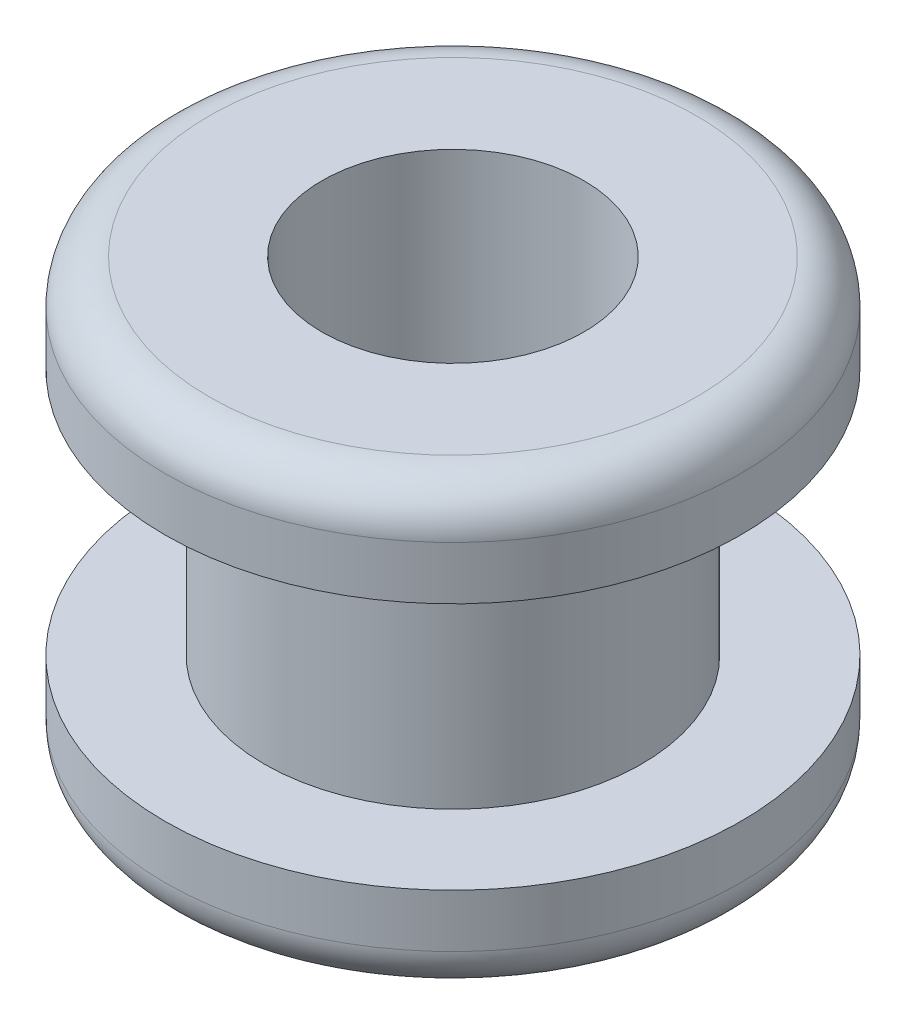
ISO-10303-21;
HEADER;
FILE_DESCRIPTION(('STEP AP214'),'2;1');
FILE_NAME('part.step','',(''),(''),'','','');
FILE_SCHEMA(('AUTOMOTIVE_DESIGN { 1 0 10303 214 1 1 1 1 }'));
ENDSEC;
DATA;
#1=APPLICATION_CONTEXT('core data for automotive mechanical design processes');
#2=APPLICATION_PROTOCOL_DEFINITION('international standard','automotive_design',2000,#1);
#3=PRODUCT_CONTEXT('',#1,'mechanical');
#4=PRODUCT('Part','Part','',(#3));
#5=PRODUCT_RELATED_PRODUCT_CATEGORY('part','',(#4));
#6=PRODUCT_DEFINITION_FORMATION('','',#4);
#7=PRODUCT_DEFINITION_CONTEXT('part definition',#1,'design');
#8=PRODUCT_DEFINITION('design','',#6,#7);
#9=PRODUCT_DEFINITION_SHAPE('','',#8);
#10=(LENGTH_UNIT() NAMED_UNIT(*) SI_UNIT(.MILLI.,.METRE.));
#11=(NAMED_UNIT(*) PLANE_ANGLE_UNIT() SI_UNIT($,.RADIAN.));
#12=(NAMED_UNIT(*) SI_UNIT($,.STERADIAN.) SOLID_ANGLE_UNIT());
#13=UNCERTAINTY_MEASURE_WITH_UNIT(LENGTH_MEASURE(1.E-05),#10,'distance_accuracy_value','');
#14=(GEOMETRIC_REPRESENTATION_CONTEXT(3) GLOBAL_UNCERTAINTY_ASSIGNED_CONTEXT((#13)) GLOBAL_UNIT_ASSIGNED_CONTEXT((#10,
#11,#12)) REPRESENTATION_CONTEXT('',''));
#15=CARTESIAN_POINT('',(0.,0.,0.));
#16=DIRECTION('',(0.,0.,1.));
#17=DIRECTION('',(1.,0.,0.));
#18=AXIS2_PLACEMENT_3D('',#15,#16,#17);
#19=CARTESIAN_POINT('',(0.,5.,0.));
#20=DIRECTION('',(0.,1.,0.));
#21=DIRECTION('',(0.,0.,1.));
#22=AXIS2_PLACEMENT_3D('',#19,#20,#21);
#23=PLANE('',#22);
#24=CARTESIAN_POINT('',(0.,5.,-1.48));
#25=DIRECTION('',(0.,1.,0.));
#26=DIRECTION('',(0.,0.,1.));
#27=AXIS2_PLACEMENT_3D('',#24,#25,#26);
#28=CIRCLE('',#27,2.74999999999999);
#29=CARTESIAN_POINT('',(0.,5.,1.26999999999999));
#30=VERTEX_POINT('',#29);
#31=EDGE_CURVE('E10',#30,#30,#28,.T.);
#32=ORIENTED_EDGE('',*,*,#31,.T.);
#33=EDGE_LOOP('',(#32));
#34=FACE_BOUND('',#33,.T.);
#35=CARTESIAN_POINT('',(0.,5.,-1.48));
#36=DIRECTION('',(0.,1.,0.));
#37=DIRECTION('',(0.,0.,1.));
#38=AXIS2_PLACEMENT_3D('',#35,#36,#37);
#39=CIRCLE('',#38,1.48);
#40=CARTESIAN_POINT('',(0.,5.,0.));
#41=VERTEX_POINT('',#40);
#42=EDGE_CURVE('E65',#41,#41,#39,.T.);
#43=ORIENTED_EDGE('',*,*,#42,.F.);
#44=EDGE_LOOP('',(#43));
#45=FACE_BOUND('',#44,.T.);
#46=ADVANCED_FACE('F31',(#34,#45),#23,.T.);
#47=CARTESIAN_POINT('',(0.,4.5,-1.48));
#48=DIRECTION('',(0.,1.,0.));
#49=DIRECTION('',(0.,0.,1.));
#50=AXIS2_PLACEMENT_3D('',#47,#48,#49);
#51=TOROIDAL_SURFACE('',#50,2.75,0.500000000000003);
#52=CARTESIAN_POINT('',(0.,4.5,-1.48));
#53=DIRECTION('',(0.,1.,0.));
#54=DIRECTION('',(0.,0.,1.));
#55=AXIS2_PLACEMENT_3D('',#52,#53,#54);
#56=CIRCLE('',#55,3.25);
#57=CARTESIAN_POINT('',(0.,4.5,1.77));
#58=VERTEX_POINT('',#57);
#59=EDGE_CURVE('E37',#58,#58,#56,.T.);
#60=ORIENTED_EDGE('',*,*,#59,.T.);
#61=EDGE_LOOP('',(#60));
#62=FACE_BOUND('',#61,.T.);
#63=ORIENTED_EDGE('',*,*,#31,.F.);
#64=EDGE_LOOP('',(#63));
#65=FACE_BOUND('',#64,.T.);
#66=ADVANCED_FACE('F73',(#62,#65),#51,.T.);
#67=CARTESIAN_POINT('',(0.,5.,-1.48));
#68=DIRECTION('',(0.,1.,0.));
#69=DIRECTION('',(0.,0.,1.));
#70=AXIS2_PLACEMENT_3D('',#67,#68,#69);
#71=CYLINDRICAL_SURFACE('',#70,3.25);
#72=CARTESIAN_POINT('',(0.,3.9,-1.48));
#73=DIRECTION('',(0.,1.,0.));
#74=DIRECTION('',(0.,0.,1.));
#75=AXIS2_PLACEMENT_3D('',#72,#73,#74);
#76=CIRCLE('',#75,3.25);
#77=CARTESIAN_POINT('',(0.,3.9,1.77));
#78=VERTEX_POINT('',#77);
#79=EDGE_CURVE('E41',#78,#78,#76,.T.);
#80=ORIENTED_EDGE('',*,*,#79,.T.);
#81=EDGE_LOOP('',(#80));
#82=FACE_BOUND('',#81,.T.);
#83=ORIENTED_EDGE('',*,*,#59,.F.);
#84=EDGE_LOOP('',(#83));
#85=FACE_BOUND('',#84,.T.);
#86=ADVANCED_FACE('F77',(#82,#85),#71,.T.);
#87=CARTESIAN_POINT('',(0.,3.9,0.65));
#88=DIRECTION('',(0.,-1.,0.));
#89=DIRECTION('',(0.,0.,-1.));
#90=AXIS2_PLACEMENT_3D('',#87,#88,#89);
#91=PLANE('',#90);
#92=CARTESIAN_POINT('',(0.,3.9,-1.48));
#93=DIRECTION('',(0.,1.,0.));
#94=DIRECTION('',(0.,0.,1.));
#95=AXIS2_PLACEMENT_3D('',#92,#93,#94);
#96=CIRCLE('',#95,2.13);
#97=CARTESIAN_POINT('',(0.,3.9,0.649999999999999));
#98=VERTEX_POINT('',#97);
#99=EDGE_CURVE('E45',#98,#98,#96,.T.);
#100=ORIENTED_EDGE('',*,*,#99,.T.);
#101=EDGE_LOOP('',(#100));
#102=FACE_BOUND('',#101,.T.);
#103=ORIENTED_EDGE('',*,*,#79,.F.);
#104=EDGE_LOOP('',(#103));
#105=FACE_BOUND('',#104,.T.);
#106=ADVANCED_FACE('F81',(#102,#105),#91,.T.);
#107=CARTESIAN_POINT('',(0.,5.,-1.48));
#108=DIRECTION('',(0.,1.,0.));
#109=DIRECTION('',(0.,0.,1.));
#110=AXIS2_PLACEMENT_3D('',#107,#108,#109);
#111=CYLINDRICAL_SURFACE('',#110,2.13);
#112=CARTESIAN_POINT('',(0.,1.1,-1.48));
#113=DIRECTION('',(0.,1.,0.));
#114=DIRECTION('',(0.,0.,1.));
#115=AXIS2_PLACEMENT_3D('',#112,#113,#114);
#116=CIRCLE('',#115,2.13);
#117=CARTESIAN_POINT('',(0.,1.1,0.649999999999999));
#118=VERTEX_POINT('',#117);
#119=EDGE_CURVE('E50',#118,#118,#116,.T.);
#120=ORIENTED_EDGE('',*,*,#119,.T.);
#121=EDGE_LOOP('',(#120));
#122=FACE_BOUND('',#121,.T.);
#123=ORIENTED_EDGE('',*,*,#99,.F.);
#124=EDGE_LOOP('',(#123));
#125=FACE_BOUND('',#124,.T.);
#126=ADVANCED_FACE('F88',(#122,#125),#111,.T.);
#127=CARTESIAN_POINT('',(0.,1.1,0.649999999999999));
#128=DIRECTION('',(0.,1.,0.));
#129=DIRECTION('',(0.,0.,1.));
#130=AXIS2_PLACEMENT_3D('',#127,#128,#129);
#131=PLANE('',#130);
#132=CARTESIAN_POINT('',(0.,1.1,-1.48));
#133=DIRECTION('',(0.,1.,0.));
#134=DIRECTION('',(0.,0.,1.));
#135=AXIS2_PLACEMENT_3D('',#132,#133,#134);
#136=CIRCLE('',#135,3.25);
#137=CARTESIAN_POINT('',(0.,1.1,1.77));
#138=VERTEX_POINT('',#137);
#139=EDGE_CURVE('E53',#138,#138,#136,.T.);
#140=ORIENTED_EDGE('',*,*,#139,.T.);
#141=EDGE_LOOP('',(#140));
#142=FACE_BOUND('',#141,.T.);
#143=ORIENTED_EDGE('',*,*,#119,.F.);
#144=EDGE_LOOP('',(#143));
#145=FACE_BOUND('',#144,.T.);
#146=ADVANCED_FACE('F92',(#142,#145),#131,.T.);
#147=CARTESIAN_POINT('',(0.,5.,-1.48));
#148=DIRECTION('',(0.,1.,0.));
#149=DIRECTION('',(0.,0.,1.));
#150=AXIS2_PLACEMENT_3D('',#147,#148,#149);
#151=CYLINDRICAL_SURFACE('',#150,3.25);
#152=CARTESIAN_POINT('',(0.,0.500000000000004,-1.48));
#153=DIRECTION('',(0.,1.,0.));
#154=DIRECTION('',(0.,0.,1.));
#155=AXIS2_PLACEMENT_3D('',#152,#153,#154);
#156=CIRCLE('',#155,3.25);
#157=CARTESIAN_POINT('',(0.,0.500000000000003,1.77));
#158=VERTEX_POINT('',#157);
#159=EDGE_CURVE('E56',#158,#158,#156,.T.);
#160=ORIENTED_EDGE('',*,*,#159,.T.);
#161=EDGE_LOOP('',(#160));
#162=FACE_BOUND('',#161,.T.);
#163=ORIENTED_EDGE('',*,*,#139,.F.);
#164=EDGE_LOOP('',(#163));
#165=FACE_BOUND('',#164,.T.);
#166=ADVANCED_FACE('F96',(#162,#165),#151,.T.);
#167=CARTESIAN_POINT('',(0.,0.500000000000003,-1.48));
#168=DIRECTION('',(0.,1.,0.));
#169=DIRECTION('',(0.,0.,1.));
#170=AXIS2_PLACEMENT_3D('',#167,#168,#169);
#171=TOROIDAL_SURFACE('',#170,2.75,0.500000000000003);
#172=CARTESIAN_POINT('',(0.,0.,-1.48));
#173=DIRECTION('',(0.,1.,0.));
#174=DIRECTION('',(0.,0.,1.));
#175=AXIS2_PLACEMENT_3D('',#172,#173,#174);
#176=CIRCLE('',#175,2.74999999999999);
#177=CARTESIAN_POINT('',(0.,0.,1.26999999999999));
#178=VERTEX_POINT('',#177);
#179=EDGE_CURVE('E59',#178,#178,#176,.T.);
#180=ORIENTED_EDGE('',*,*,#179,.T.);
#181=EDGE_LOOP('',(#180));
#182=FACE_BOUND('',#181,.T.);
#183=ORIENTED_EDGE('',*,*,#159,.F.);
#184=EDGE_LOOP('',(#183));
#185=FACE_BOUND('',#184,.T.);
#186=ADVANCED_FACE('F100',(#182,#185),#171,.T.);
#187=CARTESIAN_POINT('',(0.,0.,0.));
#188=DIRECTION('',(0.,-1.,0.));
#189=DIRECTION('',(0.,0.,-1.));
#190=AXIS2_PLACEMENT_3D('',#187,#188,#189);
#191=PLANE('',#190);
#192=CARTESIAN_POINT('',(0.,0.,-1.48));
#193=DIRECTION('',(0.,1.,0.));
#194=DIRECTION('',(0.,0.,1.));
#195=AXIS2_PLACEMENT_3D('',#192,#193,#194);
#196=CIRCLE('',#195,1.48);
#197=CARTESIAN_POINT('',(0.,0.,0.));
#198=VERTEX_POINT('',#197);
#199=EDGE_CURVE('E62',#198,#198,#196,.T.);
#200=ORIENTED_EDGE('',*,*,#199,.T.);
#201=EDGE_LOOP('',(#200));
#202=FACE_BOUND('',#201,.T.);
#203=ORIENTED_EDGE('',*,*,#179,.F.);
#204=EDGE_LOOP('',(#203));
#205=FACE_BOUND('',#204,.T.);
#206=ADVANCED_FACE('F104',(#202,#205),#191,.T.);
#207=CARTESIAN_POINT('',(0.,5.,-1.48));
#208=DIRECTION('',(0.,1.,0.));
#209=DIRECTION('',(0.,0.,1.));
#210=AXIS2_PLACEMENT_3D('',#207,#208,#209);
#211=CYLINDRICAL_SURFACE('',#210,1.48);
#212=ORIENTED_EDGE('',*,*,#42,.T.);
#213=EDGE_LOOP('',(#212));
#214=FACE_BOUND('',#213,.T.);
#215=ORIENTED_EDGE('',*,*,#199,.F.);
#216=EDGE_LOOP('',(#215));
#217=FACE_BOUND('',#216,.T.);
#218=ADVANCED_FACE('F69',(#214,#217),#211,.F.);
#219=CLOSED_SHELL('',(#46,#66,#86,#106,#126,#146,#166,#186,#206,#218));
#220=MANIFOLD_SOLID_BREP('B2',#219);
#221=ADVANCED_BREP_SHAPE_REPRESENTATION('',(#18,#220),#14);
#222=SHAPE_DEFINITION_REPRESENTATION(#9,#221);
ENDSEC;
END-ISO-10303-21;
